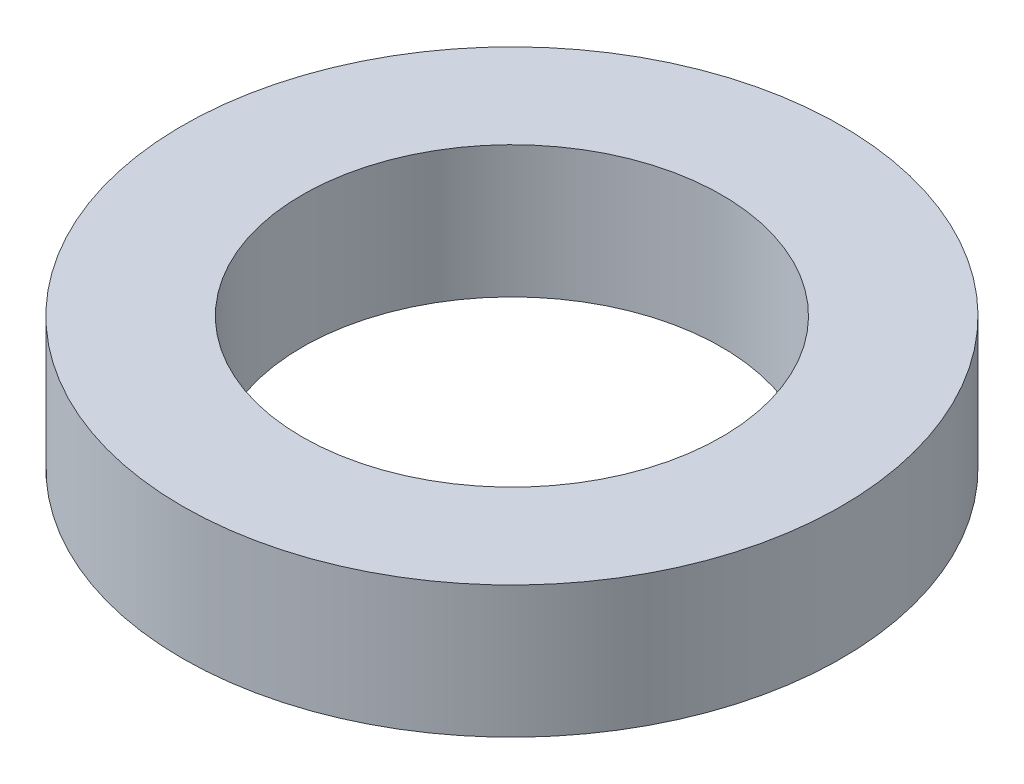
ISO-10303-21;
HEADER;
FILE_DESCRIPTION(('STEP AP214'),'2;1');
FILE_NAME('part.step','',(''),(''),'','','');
FILE_SCHEMA(('AUTOMOTIVE_DESIGN { 1 0 10303 214 1 1 1 1 }'));
ENDSEC;
DATA;
#1=APPLICATION_CONTEXT('core data for automotive mechanical design processes');
#2=APPLICATION_PROTOCOL_DEFINITION('international standard','automotive_design',2000,#1);
#3=PRODUCT_CONTEXT('',#1,'mechanical');
#4=PRODUCT('Part','Part','',(#3));
#5=PRODUCT_RELATED_PRODUCT_CATEGORY('part','',(#4));
#6=PRODUCT_DEFINITION_FORMATION('','',#4);
#7=PRODUCT_DEFINITION_CONTEXT('part definition',#1,'design');
#8=PRODUCT_DEFINITION('design','',#6,#7);
#9=PRODUCT_DEFINITION_SHAPE('','',#8);
#10=(LENGTH_UNIT() NAMED_UNIT(*) SI_UNIT(.MILLI.,.METRE.));
#11=(NAMED_UNIT(*) PLANE_ANGLE_UNIT() SI_UNIT($,.RADIAN.));
#12=(NAMED_UNIT(*) SI_UNIT($,.STERADIAN.) SOLID_ANGLE_UNIT());
#13=UNCERTAINTY_MEASURE_WITH_UNIT(LENGTH_MEASURE(1.E-05),#10,'distance_accuracy_value','');
#14=(GEOMETRIC_REPRESENTATION_CONTEXT(3) GLOBAL_UNCERTAINTY_ASSIGNED_CONTEXT((#13)) GLOBAL_UNIT_ASSIGNED_CONTEXT((#10,
#11,#12)) REPRESENTATION_CONTEXT('',''));
#15=CARTESIAN_POINT('',(0.,0.,0.));
#16=DIRECTION('',(0.,0.,1.));
#17=DIRECTION('',(1.,0.,0.));
#18=AXIS2_PLACEMENT_3D('',#15,#16,#17);
#19=CARTESIAN_POINT('',(0.,22.,0.));
#20=DIRECTION('',(0.,-1.,0.));
#21=DIRECTION('',(0.,0.,-1.));
#22=AXIS2_PLACEMENT_3D('',#19,#20,#21);
#23=CYLINDRICAL_SURFACE('',#22,55.);
#24=CARTESIAN_POINT('',(0.,22.,0.));
#25=DIRECTION('',(0.,1.,0.));
#26=DIRECTION('',(0.,0.,1.));
#27=AXIS2_PLACEMENT_3D('',#24,#25,#26);
#28=CIRCLE('',#27,55.);
#29=CARTESIAN_POINT('',(0.,22.,55.));
#30=VERTEX_POINT('',#29);
#31=EDGE_CURVE('E10',#30,#30,#28,.T.);
#32=ORIENTED_EDGE('',*,*,#31,.F.);
#33=EDGE_LOOP('',(#32));
#34=FACE_BOUND('',#33,.T.);
#35=CARTESIAN_POINT('',(0.,0.,0.));
#36=DIRECTION('',(0.,1.,0.));
#37=DIRECTION('',(0.,0.,1.));
#38=AXIS2_PLACEMENT_3D('',#35,#36,#37);
#39=CIRCLE('',#38,55.);
#40=CARTESIAN_POINT('',(0.,0.,55.));
#41=VERTEX_POINT('',#40);
#42=EDGE_CURVE('E37',#41,#41,#39,.T.);
#43=ORIENTED_EDGE('',*,*,#42,.T.);
#44=EDGE_LOOP('',(#43));
#45=FACE_BOUND('',#44,.T.);
#46=ADVANCED_FACE('F40',(#34,#45),#23,.T.);
#47=CARTESIAN_POINT('',(0.,22.,0.));
#48=DIRECTION('',(0.,1.,0.));
#49=DIRECTION('',(0.,0.,1.));
#50=AXIS2_PLACEMENT_3D('',#47,#48,#49);
#51=PLANE('',#50);
#52=CARTESIAN_POINT('',(0.,22.,0.));
#53=DIRECTION('',(0.,1.,0.));
#54=DIRECTION('',(0.,0.,1.));
#55=AXIS2_PLACEMENT_3D('',#52,#53,#54);
#56=CIRCLE('',#55,35.);
#57=CARTESIAN_POINT('',(0.,22.,35.));
#58=VERTEX_POINT('',#57);
#59=EDGE_CURVE('E50',#58,#58,#56,.T.);
#60=ORIENTED_EDGE('',*,*,#59,.F.);
#61=EDGE_LOOP('',(#60));
#62=FACE_BOUND('',#61,.T.);
#63=ORIENTED_EDGE('',*,*,#31,.T.);
#64=EDGE_LOOP('',(#63));
#65=FACE_BOUND('',#64,.T.);
#66=ADVANCED_FACE('F59',(#62,#65),#51,.T.);
#67=CARTESIAN_POINT('',(0.,0.,0.));
#68=DIRECTION('',(0.,1.,0.));
#69=DIRECTION('',(0.,0.,1.));
#70=AXIS2_PLACEMENT_3D('',#67,#68,#69);
#71=PLANE('',#70);
#72=CARTESIAN_POINT('',(0.,0.,0.));
#73=DIRECTION('',(0.,1.,0.));
#74=DIRECTION('',(0.,0.,1.));
#75=AXIS2_PLACEMENT_3D('',#72,#73,#74);
#76=CIRCLE('',#75,35.);
#77=CARTESIAN_POINT('',(0.,0.,35.));
#78=VERTEX_POINT('',#77);
#79=EDGE_CURVE('E47',#78,#78,#76,.T.);
#80=ORIENTED_EDGE('',*,*,#79,.T.);
#81=EDGE_LOOP('',(#80));
#82=FACE_BOUND('',#81,.T.);
#83=ORIENTED_EDGE('',*,*,#42,.F.);
#84=EDGE_LOOP('',(#83));
#85=FACE_BOUND('',#84,.T.);
#86=ADVANCED_FACE('F58',(#82,#85),#71,.F.);
#87=CARTESIAN_POINT('',(0.,22.,0.));
#88=DIRECTION('',(0.,-1.,0.));
#89=DIRECTION('',(0.,0.,-1.));
#90=AXIS2_PLACEMENT_3D('',#87,#88,#89);
#91=CYLINDRICAL_SURFACE('',#90,35.);
#92=ORIENTED_EDGE('',*,*,#59,.T.);
#93=EDGE_LOOP('',(#92));
#94=FACE_BOUND('',#93,.T.);
#95=ORIENTED_EDGE('',*,*,#79,.F.);
#96=EDGE_LOOP('',(#95));
#97=FACE_BOUND('',#96,.T.);
#98=ADVANCED_FACE('F54',(#94,#97),#91,.F.);
#99=CLOSED_SHELL('',(#46,#66,#86,#98));
#100=MANIFOLD_SOLID_BREP('B2',#99);
#101=ADVANCED_BREP_SHAPE_REPRESENTATION('',(#18,#100),#14);
#102=SHAPE_DEFINITION_REPRESENTATION(#9,#101);
ENDSEC;
END-ISO-10303-21;
